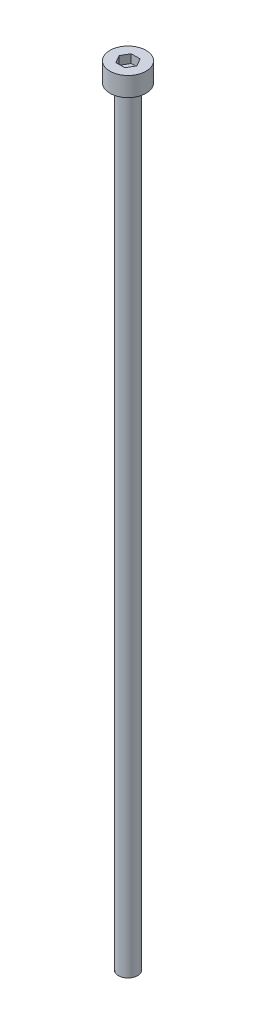
ISO-10303-21;
HEADER;
FILE_DESCRIPTION(('STEP AP214'),'2;1');
FILE_NAME('part.step','',(''),(''),'','','');
FILE_SCHEMA(('AUTOMOTIVE_DESIGN { 1 0 10303 214 1 1 1 1 }'));
ENDSEC;
DATA;
#1=APPLICATION_CONTEXT('core data for automotive mechanical design processes');
#2=APPLICATION_PROTOCOL_DEFINITION('international standard','automotive_design',2000,#1);
#3=PRODUCT_CONTEXT('',#1,'mechanical');
#4=PRODUCT('Part','Part','',(#3));
#5=PRODUCT_RELATED_PRODUCT_CATEGORY('part','',(#4));
#6=PRODUCT_DEFINITION_FORMATION('','',#4);
#7=PRODUCT_DEFINITION_CONTEXT('part definition',#1,'design');
#8=PRODUCT_DEFINITION('design','',#6,#7);
#9=PRODUCT_DEFINITION_SHAPE('','',#8);
#10=(LENGTH_UNIT() NAMED_UNIT(*) SI_UNIT(.MILLI.,.METRE.));
#11=(NAMED_UNIT(*) PLANE_ANGLE_UNIT() SI_UNIT($,.RADIAN.));
#12=(NAMED_UNIT(*) SI_UNIT($,.STERADIAN.) SOLID_ANGLE_UNIT());
#13=UNCERTAINTY_MEASURE_WITH_UNIT(LENGTH_MEASURE(1.E-05),#10,'distance_accuracy_value','');
#14=(GEOMETRIC_REPRESENTATION_CONTEXT(3) GLOBAL_UNCERTAINTY_ASSIGNED_CONTEXT((#13)) GLOBAL_UNIT_ASSIGNED_CONTEXT((#10,
#11,#12)) REPRESENTATION_CONTEXT('',''));
#15=CARTESIAN_POINT('',(0.,0.,0.));
#16=DIRECTION('',(0.,0.,1.));
#17=DIRECTION('',(1.,0.,0.));
#18=AXIS2_PLACEMENT_3D('',#15,#16,#17);
#19=CARTESIAN_POINT('',(0.,2.5,0.));
#20=DIRECTION('',(0.,-1.,0.));
#21=DIRECTION('',(0.,0.,-1.));
#22=AXIS2_PLACEMENT_3D('',#19,#20,#21);
#23=CYLINDRICAL_SURFACE('',#22,2.35);
#24=CARTESIAN_POINT('',(0.,2.5,0.));
#25=DIRECTION('',(0.,1.,0.));
#26=DIRECTION('',(0.,0.,1.));
#27=AXIS2_PLACEMENT_3D('',#24,#25,#26);
#28=CIRCLE('',#27,2.35);
#29=CARTESIAN_POINT('',(0.,2.5,2.35));
#30=VERTEX_POINT('',#29);
#31=EDGE_CURVE('E45',#30,#30,#28,.T.);
#32=ORIENTED_EDGE('',*,*,#31,.F.);
#33=EDGE_LOOP('',(#32));
#34=FACE_BOUND('',#33,.T.);
#35=CARTESIAN_POINT('',(0.,0.,0.));
#36=DIRECTION('',(0.,1.,0.));
#37=DIRECTION('',(0.,0.,1.));
#38=AXIS2_PLACEMENT_3D('',#35,#36,#37);
#39=CIRCLE('',#38,2.35);
#40=CARTESIAN_POINT('',(0.,0.,2.35));
#41=VERTEX_POINT('',#40);
#42=EDGE_CURVE('E40',#41,#41,#39,.T.);
#43=ORIENTED_EDGE('',*,*,#42,.T.);
#44=EDGE_LOOP('',(#43));
#45=FACE_BOUND('',#44,.T.);
#46=ADVANCED_FACE('F37',(#34,#45),#23,.T.);
#47=CARTESIAN_POINT('',(0.,2.5,0.));
#48=DIRECTION('',(0.,1.,0.));
#49=DIRECTION('',(0.,0.,1.));
#50=AXIS2_PLACEMENT_3D('',#47,#48,#49);
#51=PLANE('',#50);
#52=DIRECTION('',(0.5,0.,-0.866025403784439));
#53=VECTOR('',#52,1.);
#54=CARTESIAN_POINT('',(0.577350269189626,2.5,1.));
#55=LINE('',#54,#53);
#56=CARTESIAN_POINT('',(0.577350269189626,2.5,1.));
#57=VERTEX_POINT('',#56);
#58=CARTESIAN_POINT('',(1.15470053837925,2.5,0.));
#59=VERTEX_POINT('',#58);
#60=EDGE_CURVE('E53',#57,#59,#55,.T.);
#61=ORIENTED_EDGE('',*,*,#60,.F.);
#62=DIRECTION('',(1.,0.,0.));
#63=VECTOR('',#62,1.);
#64=CARTESIAN_POINT('',(-0.577350269189627,2.5,1.));
#65=LINE('',#64,#63);
#66=CARTESIAN_POINT('',(-0.577350269189627,2.5,1.));
#67=VERTEX_POINT('',#66);
#68=EDGE_CURVE('E137',#67,#57,#65,.T.);
#69=ORIENTED_EDGE('',*,*,#68,.F.);
#70=DIRECTION('',(0.5,0.,0.866025403784439));
#71=VECTOR('',#70,1.);
#72=CARTESIAN_POINT('',(-1.15470053837925,2.5,0.));
#73=LINE('',#72,#71);
#74=CARTESIAN_POINT('',(-1.15470053837925,2.5,0.));
#75=VERTEX_POINT('',#74);
#76=EDGE_CURVE('E135',#75,#67,#73,.T.);
#77=ORIENTED_EDGE('',*,*,#76,.F.);
#78=DIRECTION('',(-0.5,0.,0.866025403784438));
#79=VECTOR('',#78,1.);
#80=CARTESIAN_POINT('',(-0.577350269189626,2.5,-1.));
#81=LINE('',#80,#79);
#82=CARTESIAN_POINT('',(-0.577350269189626,2.5,-1.));
#83=VERTEX_POINT('',#82);
#84=EDGE_CURVE('E101',#83,#75,#81,.T.);
#85=ORIENTED_EDGE('',*,*,#84,.F.);
#86=DIRECTION('',(-1.,0.,0.));
#87=VECTOR('',#86,1.);
#88=CARTESIAN_POINT('',(0.577350269189626,2.5,-1.));
#89=LINE('',#88,#87);
#90=CARTESIAN_POINT('',(0.577350269189626,2.5,-1.));
#91=VERTEX_POINT('',#90);
#92=EDGE_CURVE('E131',#91,#83,#89,.T.);
#93=ORIENTED_EDGE('',*,*,#92,.F.);
#94=DIRECTION('',(-0.5,0.,-0.866025403784439));
#95=VECTOR('',#94,1.);
#96=CARTESIAN_POINT('',(1.15470053837925,2.5,0.));
#97=LINE('',#96,#95);
#98=EDGE_CURVE('E127',#59,#91,#97,.T.);
#99=ORIENTED_EDGE('',*,*,#98,.F.);
#100=EDGE_LOOP('',(#61,#69,#77,#85,#93,#99));
#101=FACE_BOUND('',#100,.T.);
#102=ORIENTED_EDGE('',*,*,#31,.T.);
#103=EDGE_LOOP('',(#102));
#104=FACE_BOUND('',#103,.T.);
#105=ADVANCED_FACE('F155',(#101,#104),#51,.T.);
#106=CARTESIAN_POINT('',(0.,0.,0.));
#107=DIRECTION('',(0.,1.,0.));
#108=DIRECTION('',(0.,0.,1.));
#109=AXIS2_PLACEMENT_3D('',#106,#107,#108);
#110=PLANE('',#109);
#111=CARTESIAN_POINT('',(0.,0.,0.));
#112=DIRECTION('',(0.,-1.,0.));
#113=DIRECTION('',(0.,0.,-1.));
#114=AXIS2_PLACEMENT_3D('',#111,#112,#113);
#115=CIRCLE('',#114,1.25);
#116=CARTESIAN_POINT('',(0.,0.,-1.25));
#117=VERTEX_POINT('',#116);
#118=EDGE_CURVE('E11',#117,#117,#115,.T.);
#119=ORIENTED_EDGE('',*,*,#118,.F.);
#120=EDGE_LOOP('',(#119));
#121=FACE_BOUND('',#120,.T.);
#122=ORIENTED_EDGE('',*,*,#42,.F.);
#123=EDGE_LOOP('',(#122));
#124=FACE_BOUND('',#123,.T.);
#125=ADVANCED_FACE('F152',(#121,#124),#110,.F.);
#126=CARTESIAN_POINT('',(0.577350269189626,1.4,1.));
#127=DIRECTION('',(0.866025403784439,0.,0.5));
#128=DIRECTION('',(0.5,0.,-0.866025403784439));
#129=AXIS2_PLACEMENT_3D('',#126,#127,#128);
#130=PLANE('',#129);
#131=ORIENTED_EDGE('',*,*,#60,.T.);
#132=DIRECTION('',(0.,1.,0.));
#133=VECTOR('',#132,1.);
#134=CARTESIAN_POINT('',(1.15470053837925,1.4,0.));
#135=LINE('',#134,#133);
#136=CARTESIAN_POINT('',(1.15470053837925,1.4,0.));
#137=VERTEX_POINT('',#136);
#138=EDGE_CURVE('E83',#137,#59,#135,.T.);
#139=ORIENTED_EDGE('',*,*,#138,.F.);
#140=DIRECTION('',(0.5,0.,-0.866025403784439));
#141=VECTOR('',#140,1.);
#142=CARTESIAN_POINT('',(0.577350269189626,1.4,1.));
#143=LINE('',#142,#141);
#144=CARTESIAN_POINT('',(0.577350269189626,1.4,1.));
#145=VERTEX_POINT('',#144);
#146=EDGE_CURVE('E139',#145,#137,#143,.T.);
#147=ORIENTED_EDGE('',*,*,#146,.F.);
#148=DIRECTION('',(0.,1.,0.));
#149=VECTOR('',#148,1.);
#150=CARTESIAN_POINT('',(0.577350269189626,1.4,1.));
#151=LINE('',#150,#149);
#152=EDGE_CURVE('E61',#145,#57,#151,.T.);
#153=ORIENTED_EDGE('',*,*,#152,.T.);
#154=EDGE_LOOP('',(#131,#139,#147,#153));
#155=FACE_BOUND('',#154,.T.);
#156=ADVANCED_FACE('F154',(#155),#130,.F.);
#157=CARTESIAN_POINT('',(-0.577350269189627,1.4,1.));
#158=DIRECTION('',(0.,0.,1.));
#159=DIRECTION('',(1.,0.,0.));
#160=AXIS2_PLACEMENT_3D('',#157,#158,#159);
#161=PLANE('',#160);
#162=ORIENTED_EDGE('',*,*,#68,.T.);
#163=ORIENTED_EDGE('',*,*,#152,.F.);
#164=DIRECTION('',(1.,0.,0.));
#165=VECTOR('',#164,1.);
#166=CARTESIAN_POINT('',(-0.577350269189627,1.4,1.));
#167=LINE('',#166,#165);
#168=CARTESIAN_POINT('',(-0.577350269189627,1.4,1.));
#169=VERTEX_POINT('',#168);
#170=EDGE_CURVE('E113',#169,#145,#167,.T.);
#171=ORIENTED_EDGE('',*,*,#170,.F.);
#172=DIRECTION('',(0.,1.,0.));
#173=VECTOR('',#172,1.);
#174=CARTESIAN_POINT('',(-0.577350269189627,1.4,1.));
#175=LINE('',#174,#173);
#176=EDGE_CURVE('E105',#169,#67,#175,.T.);
#177=ORIENTED_EDGE('',*,*,#176,.T.);
#178=EDGE_LOOP('',(#162,#163,#171,#177));
#179=FACE_BOUND('',#178,.T.);
#180=ADVANCED_FACE('F161',(#179),#161,.F.);
#181=CARTESIAN_POINT('',(-1.15470053837925,1.4,0.));
#182=DIRECTION('',(-0.866025403784439,0.,0.5));
#183=DIRECTION('',(0.5,0.,0.866025403784439));
#184=AXIS2_PLACEMENT_3D('',#181,#182,#183);
#185=PLANE('',#184);
#186=ORIENTED_EDGE('',*,*,#76,.T.);
#187=ORIENTED_EDGE('',*,*,#176,.F.);
#188=DIRECTION('',(0.5,0.,0.866025403784439));
#189=VECTOR('',#188,1.);
#190=CARTESIAN_POINT('',(-1.15470053837925,1.4,0.));
#191=LINE('',#190,#189);
#192=CARTESIAN_POINT('',(-1.15470053837925,1.4,0.));
#193=VERTEX_POINT('',#192);
#194=EDGE_CURVE('E109',#193,#169,#191,.T.);
#195=ORIENTED_EDGE('',*,*,#194,.F.);
#196=DIRECTION('',(0.,1.,0.));
#197=VECTOR('',#196,1.);
#198=CARTESIAN_POINT('',(-1.15470053837925,1.4,0.));
#199=LINE('',#198,#197);
#200=EDGE_CURVE('E94',#193,#75,#199,.T.);
#201=ORIENTED_EDGE('',*,*,#200,.T.);
#202=EDGE_LOOP('',(#186,#187,#195,#201));
#203=FACE_BOUND('',#202,.T.);
#204=ADVANCED_FACE('F110',(#203),#185,.F.);
#205=CARTESIAN_POINT('',(-0.577350269189626,1.4,-1.));
#206=DIRECTION('',(-0.866025403784439,0.,-0.5));
#207=DIRECTION('',(-0.5,0.,0.866025403784438));
#208=AXIS2_PLACEMENT_3D('',#205,#206,#207);
#209=PLANE('',#208);
#210=ORIENTED_EDGE('',*,*,#84,.T.);
#211=ORIENTED_EDGE('',*,*,#200,.F.);
#212=DIRECTION('',(-0.5,0.,0.866025403784438));
#213=VECTOR('',#212,1.);
#214=CARTESIAN_POINT('',(-0.577350269189626,1.4,-1.));
#215=LINE('',#214,#213);
#216=CARTESIAN_POINT('',(-0.577350269189626,1.4,-1.));
#217=VERTEX_POINT('',#216);
#218=EDGE_CURVE('E98',#217,#193,#215,.T.);
#219=ORIENTED_EDGE('',*,*,#218,.F.);
#220=DIRECTION('',(0.,1.,0.));
#221=VECTOR('',#220,1.);
#222=CARTESIAN_POINT('',(-0.577350269189626,1.4,-1.));
#223=LINE('',#222,#221);
#224=EDGE_CURVE('E106',#217,#83,#223,.T.);
#225=ORIENTED_EDGE('',*,*,#224,.T.);
#226=EDGE_LOOP('',(#210,#211,#219,#225));
#227=FACE_BOUND('',#226,.T.);
#228=ADVANCED_FACE('F96',(#227),#209,.F.);
#229=CARTESIAN_POINT('',(0.577350269189626,1.4,-1.));
#230=DIRECTION('',(0.,0.,-1.));
#231=DIRECTION('',(-1.,0.,0.));
#232=AXIS2_PLACEMENT_3D('',#229,#230,#231);
#233=PLANE('',#232);
#234=ORIENTED_EDGE('',*,*,#92,.T.);
#235=ORIENTED_EDGE('',*,*,#224,.F.);
#236=DIRECTION('',(-1.,0.,0.));
#237=VECTOR('',#236,1.);
#238=CARTESIAN_POINT('',(0.577350269189626,1.4,-1.));
#239=LINE('',#238,#237);
#240=CARTESIAN_POINT('',(0.577350269189626,1.4,-1.));
#241=VERTEX_POINT('',#240);
#242=EDGE_CURVE('E119',#241,#217,#239,.T.);
#243=ORIENTED_EDGE('',*,*,#242,.F.);
#244=DIRECTION('',(0.,1.,0.));
#245=VECTOR('',#244,1.);
#246=CARTESIAN_POINT('',(0.577350269189626,1.4,-1.));
#247=LINE('',#246,#245);
#248=EDGE_CURVE('E143',#241,#91,#247,.T.);
#249=ORIENTED_EDGE('',*,*,#248,.T.);
#250=EDGE_LOOP('',(#234,#235,#243,#249));
#251=FACE_BOUND('',#250,.T.);
#252=ADVANCED_FACE('F206',(#251),#233,.F.);
#253=CARTESIAN_POINT('',(1.15470053837925,1.4,0.));
#254=DIRECTION('',(0.866025403784439,0.,-0.5));
#255=DIRECTION('',(-0.5,0.,-0.866025403784439));
#256=AXIS2_PLACEMENT_3D('',#253,#254,#255);
#257=PLANE('',#256);
#258=ORIENTED_EDGE('',*,*,#98,.T.);
#259=ORIENTED_EDGE('',*,*,#248,.F.);
#260=DIRECTION('',(-0.5,0.,-0.866025403784439));
#261=VECTOR('',#260,1.);
#262=CARTESIAN_POINT('',(1.15470053837925,1.4,0.));
#263=LINE('',#262,#261);
#264=EDGE_CURVE('E121',#137,#241,#263,.T.);
#265=ORIENTED_EDGE('',*,*,#264,.F.);
#266=ORIENTED_EDGE('',*,*,#138,.T.);
#267=EDGE_LOOP('',(#258,#259,#265,#266));
#268=FACE_BOUND('',#267,.T.);
#269=ADVANCED_FACE('F215',(#268),#257,.F.);
#270=CARTESIAN_POINT('',(0.,1.4,0.));
#271=DIRECTION('',(0.,1.,0.));
#272=DIRECTION('',(0.,0.,1.));
#273=AXIS2_PLACEMENT_3D('',#270,#271,#272);
#274=PLANE('',#273);
#275=ORIENTED_EDGE('',*,*,#146,.T.);
#276=ORIENTED_EDGE('',*,*,#264,.T.);
#277=ORIENTED_EDGE('',*,*,#242,.T.);
#278=ORIENTED_EDGE('',*,*,#218,.T.);
#279=ORIENTED_EDGE('',*,*,#194,.T.);
#280=ORIENTED_EDGE('',*,*,#170,.T.);
#281=EDGE_LOOP('',(#275,#276,#277,#278,#279,#280));
#282=FACE_BOUND('',#281,.T.);
#283=ADVANCED_FACE('F116',(#282),#274,.T.);
#284=CARTESIAN_POINT('',(0.,-100.,0.));
#285=DIRECTION('',(0.,1.,0.));
#286=DIRECTION('',(0.,0.,1.));
#287=AXIS2_PLACEMENT_3D('',#284,#285,#286);
#288=CYLINDRICAL_SURFACE('',#287,1.25);
#289=CARTESIAN_POINT('',(0.,-100.,0.));
#290=DIRECTION('',(0.,-1.,0.));
#291=DIRECTION('',(0.,0.,-1.));
#292=AXIS2_PLACEMENT_3D('',#289,#290,#291);
#293=CIRCLE('',#292,1.25);
#294=CARTESIAN_POINT('',(0.,-100.,-1.25));
#295=VERTEX_POINT('',#294);
#296=EDGE_CURVE('E128',#295,#295,#293,.T.);
#297=ORIENTED_EDGE('',*,*,#296,.F.);
#298=EDGE_LOOP('',(#297));
#299=FACE_BOUND('',#298,.T.);
#300=ORIENTED_EDGE('',*,*,#118,.T.);
#301=EDGE_LOOP('',(#300));
#302=FACE_BOUND('',#301,.T.);
#303=ADVANCED_FACE('F233',(#299,#302),#288,.T.);
#304=CARTESIAN_POINT('',(0.,-100.,0.));
#305=DIRECTION('',(0.,-1.,0.));
#306=DIRECTION('',(0.,0.,-1.));
#307=AXIS2_PLACEMENT_3D('',#304,#305,#306);
#308=PLANE('',#307);
#309=ORIENTED_EDGE('',*,*,#296,.T.);
#310=EDGE_LOOP('',(#309));
#311=FACE_BOUND('',#310,.T.);
#312=ADVANCED_FACE('F247',(#311),#308,.T.);
#313=CLOSED_SHELL('',(#46,#105,#125,#156,#180,#204,#228,#252,#269,#283,#303,#312));
#314=MANIFOLD_SOLID_BREP('B2',#313);
#315=ADVANCED_BREP_SHAPE_REPRESENTATION('',(#18,#314),#14);
#316=SHAPE_DEFINITION_REPRESENTATION(#9,#315);
ENDSEC;
END-ISO-10303-21;
